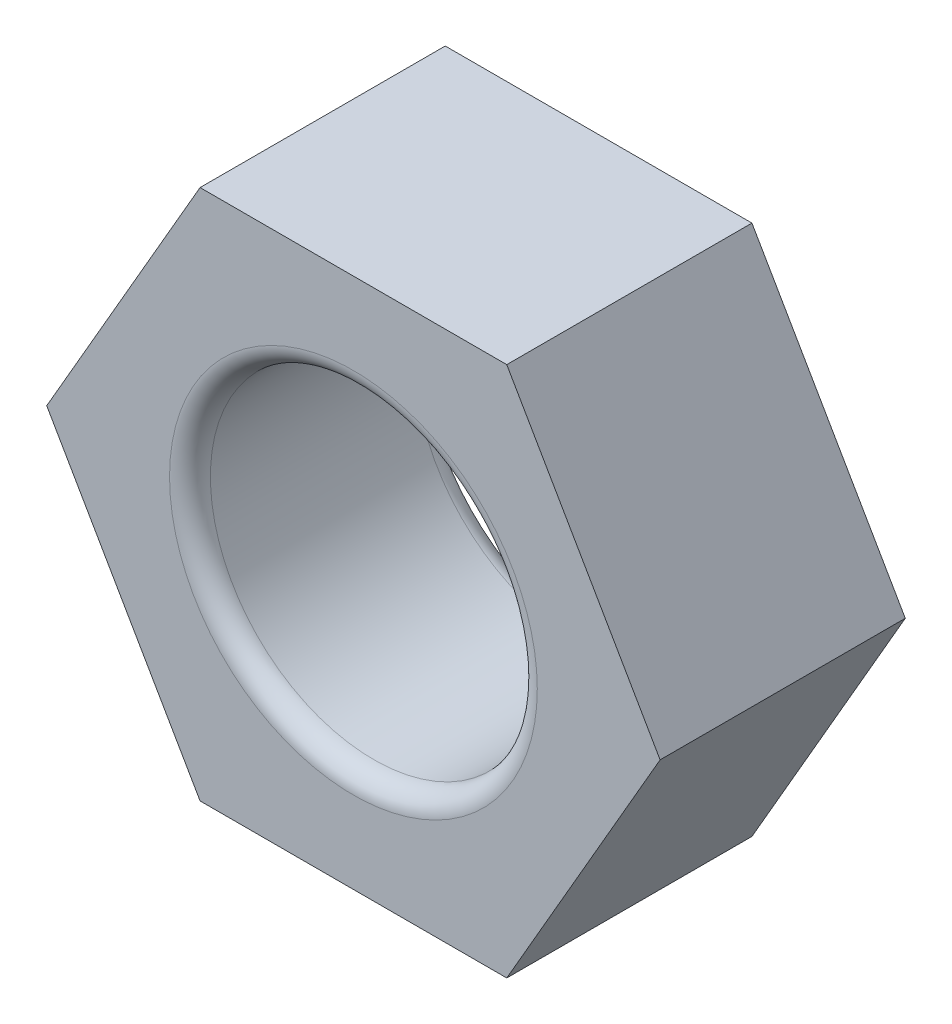
ISO-10303-21;
HEADER;
FILE_DESCRIPTION(('STEP AP214'),'2;1');
FILE_NAME('part.step','',(''),(''),'','','');
FILE_SCHEMA(('AUTOMOTIVE_DESIGN { 1 0 10303 214 1 1 1 1 }'));
ENDSEC;
DATA;
#1=APPLICATION_CONTEXT('core data for automotive mechanical design processes');
#2=APPLICATION_PROTOCOL_DEFINITION('international standard','automotive_design',2000,#1);
#3=PRODUCT_CONTEXT('',#1,'mechanical');
#4=PRODUCT('Part','Part','',(#3));
#5=PRODUCT_RELATED_PRODUCT_CATEGORY('part','',(#4));
#6=PRODUCT_DEFINITION_FORMATION('','',#4);
#7=PRODUCT_DEFINITION_CONTEXT('part definition',#1,'design');
#8=PRODUCT_DEFINITION('design','',#6,#7);
#9=PRODUCT_DEFINITION_SHAPE('','',#8);
#10=(LENGTH_UNIT() NAMED_UNIT(*) SI_UNIT(.MILLI.,.METRE.));
#11=(NAMED_UNIT(*) PLANE_ANGLE_UNIT() SI_UNIT($,.RADIAN.));
#12=(NAMED_UNIT(*) SI_UNIT($,.STERADIAN.) SOLID_ANGLE_UNIT());
#13=UNCERTAINTY_MEASURE_WITH_UNIT(LENGTH_MEASURE(1.E-05),#10,'distance_accuracy_value','');
#14=(GEOMETRIC_REPRESENTATION_CONTEXT(3) GLOBAL_UNCERTAINTY_ASSIGNED_CONTEXT((#13)) GLOBAL_UNIT_ASSIGNED_CONTEXT((#10,
#11,#12)) REPRESENTATION_CONTEXT('',''));
#15=CARTESIAN_POINT('',(0.,0.,0.));
#16=DIRECTION('',(0.,0.,1.));
#17=DIRECTION('',(1.,0.,0.));
#18=AXIS2_PLACEMENT_3D('',#15,#16,#17);
#19=CARTESIAN_POINT('',(-7.50555349946511,0.,6.));
#20=DIRECTION('',(0.,0.,1.));
#21=DIRECTION('',(1.,0.,0.));
#22=AXIS2_PLACEMENT_3D('',#19,#20,#21);
#23=PLANE('',#22);
#24=CARTESIAN_POINT('',(0.,0.,6.));
#25=DIRECTION('',(0.,0.,1.));
#26=DIRECTION('',(1.,0.,0.));
#27=AXIS2_PLACEMENT_3D('',#24,#25,#26);
#28=CIRCLE('',#27,4.5);
#29=CARTESIAN_POINT('',(4.5,0.,6.));
#30=VERTEX_POINT('',#29);
#31=EDGE_CURVE('E11',#30,#30,#28,.F.);
#32=ORIENTED_EDGE('',*,*,#31,.T.);
#33=EDGE_LOOP('',(#32));
#34=FACE_BOUND('',#33,.T.);
#35=DIRECTION('',(-0.500000000000007,-0.866025403784434,0.));
#36=VECTOR('',#35,1.);
#37=CARTESIAN_POINT('',(-3.75277674973252,6.5,6.));
#38=LINE('',#37,#36);
#39=CARTESIAN_POINT('',(-3.75277674973252,6.5,6.));
#40=VERTEX_POINT('',#39);
#41=CARTESIAN_POINT('',(-7.50555349946511,0.,6.));
#42=VERTEX_POINT('',#41);
#43=EDGE_CURVE('E126',#40,#42,#38,.T.);
#44=ORIENTED_EDGE('',*,*,#43,.T.);
#45=DIRECTION('',(0.499999999999998,-0.86602540378444,0.));
#46=VECTOR('',#45,1.);
#47=CARTESIAN_POINT('',(-7.50555349946511,0.,6.));
#48=LINE('',#47,#46);
#49=CARTESIAN_POINT('',(-3.75277674973253,-6.49999999999997,6.));
#50=VERTEX_POINT('',#49);
#51=EDGE_CURVE('E86',#42,#50,#48,.T.);
#52=ORIENTED_EDGE('',*,*,#51,.T.);
#53=DIRECTION('',(1.,0.,0.));
#54=VECTOR('',#53,1.);
#55=CARTESIAN_POINT('',(-3.75277674973253,-6.49999999999997,6.));
#56=LINE('',#55,#54);
#57=CARTESIAN_POINT('',(3.75277674973263,-6.49999999999986,6.));
#58=VERTEX_POINT('',#57);
#59=EDGE_CURVE('E98',#50,#58,#56,.T.);
#60=ORIENTED_EDGE('',*,*,#59,.T.);
#61=DIRECTION('',(0.500000000000013,0.866025403784431,0.));
#62=VECTOR('',#61,1.);
#63=CARTESIAN_POINT('',(3.75277674973263,-6.49999999999986,6.));
#64=LINE('',#63,#62);
#65=CARTESIAN_POINT('',(7.5055534994653,0.,6.));
#66=VERTEX_POINT('',#65);
#67=EDGE_CURVE('E93',#58,#66,#64,.T.);
#68=ORIENTED_EDGE('',*,*,#67,.T.);
#69=DIRECTION('',(-0.5,0.866025403784439,0.));
#70=VECTOR('',#69,1.);
#71=CARTESIAN_POINT('',(7.5055534994653,0.,6.));
#72=LINE('',#71,#70);
#73=CARTESIAN_POINT('',(3.7527767497327,6.50000000000014,6.));
#74=VERTEX_POINT('',#73);
#75=EDGE_CURVE('E96',#66,#74,#72,.T.);
#76=ORIENTED_EDGE('',*,*,#75,.T.);
#77=DIRECTION('',(-1.,0.,0.));
#78=VECTOR('',#77,1.);
#79=CARTESIAN_POINT('',(3.7527767497327,6.50000000000014,6.));
#80=LINE('',#79,#78);
#81=EDGE_CURVE('E48',#74,#40,#80,.T.);
#82=ORIENTED_EDGE('',*,*,#81,.T.);
#83=EDGE_LOOP('',(#44,#52,#60,#68,#76,#82));
#84=FACE_BOUND('',#83,.T.);
#85=ADVANCED_FACE('F31',(#34,#84),#23,.T.);
#86=CARTESIAN_POINT('',(-7.50555349946511,0.,0.));
#87=DIRECTION('',(0.,0.,1.));
#88=DIRECTION('',(1.,0.,0.));
#89=AXIS2_PLACEMENT_3D('',#86,#87,#88);
#90=PLANE('',#89);
#91=CARTESIAN_POINT('',(0.,0.,0.));
#92=DIRECTION('',(0.,0.,1.));
#93=DIRECTION('',(1.,0.,0.));
#94=AXIS2_PLACEMENT_3D('',#91,#92,#93);
#95=CIRCLE('',#94,4.5);
#96=CARTESIAN_POINT('',(4.5,0.,0.));
#97=VERTEX_POINT('',#96);
#98=EDGE_CURVE('E135',#97,#97,#95,.T.);
#99=ORIENTED_EDGE('',*,*,#98,.T.);
#100=EDGE_LOOP('',(#99));
#101=FACE_BOUND('',#100,.T.);
#102=DIRECTION('',(-0.500000000000007,-0.866025403784434,0.));
#103=VECTOR('',#102,1.);
#104=CARTESIAN_POINT('',(-3.75277674973252,6.5,0.));
#105=LINE('',#104,#103);
#106=CARTESIAN_POINT('',(-3.75277674973252,6.5,0.));
#107=VERTEX_POINT('',#106);
#108=CARTESIAN_POINT('',(-7.50555349946511,0.,0.));
#109=VERTEX_POINT('',#108);
#110=EDGE_CURVE('E116',#107,#109,#105,.T.);
#111=ORIENTED_EDGE('',*,*,#110,.F.);
#112=DIRECTION('',(-1.,0.,0.));
#113=VECTOR('',#112,1.);
#114=CARTESIAN_POINT('',(3.7527767497327,6.50000000000014,0.));
#115=LINE('',#114,#113);
#116=CARTESIAN_POINT('',(3.7527767497327,6.50000000000014,0.));
#117=VERTEX_POINT('',#116);
#118=EDGE_CURVE('E77',#117,#107,#115,.T.);
#119=ORIENTED_EDGE('',*,*,#118,.F.);
#120=DIRECTION('',(-0.5,0.866025403784439,0.));
#121=VECTOR('',#120,1.);
#122=CARTESIAN_POINT('',(7.5055534994653,0.,0.));
#123=LINE('',#122,#121);
#124=CARTESIAN_POINT('',(7.5055534994653,0.,0.));
#125=VERTEX_POINT('',#124);
#126=EDGE_CURVE('E71',#125,#117,#123,.T.);
#127=ORIENTED_EDGE('',*,*,#126,.F.);
#128=DIRECTION('',(0.500000000000013,0.866025403784431,0.));
#129=VECTOR('',#128,1.);
#130=CARTESIAN_POINT('',(3.75277674973263,-6.49999999999986,0.));
#131=LINE('',#130,#129);
#132=CARTESIAN_POINT('',(3.75277674973263,-6.49999999999986,0.));
#133=VERTEX_POINT('',#132);
#134=EDGE_CURVE('E106',#133,#125,#131,.T.);
#135=ORIENTED_EDGE('',*,*,#134,.F.);
#136=DIRECTION('',(1.,0.,0.));
#137=VECTOR('',#136,1.);
#138=CARTESIAN_POINT('',(-3.75277674973253,-6.49999999999997,0.));
#139=LINE('',#138,#137);
#140=CARTESIAN_POINT('',(-3.75277674973253,-6.49999999999997,0.));
#141=VERTEX_POINT('',#140);
#142=EDGE_CURVE('E121',#141,#133,#139,.T.);
#143=ORIENTED_EDGE('',*,*,#142,.F.);
#144=DIRECTION('',(0.499999999999998,-0.86602540378444,0.));
#145=VECTOR('',#144,1.);
#146=CARTESIAN_POINT('',(-7.50555349946511,0.,0.));
#147=LINE('',#146,#145);
#148=EDGE_CURVE('E119',#109,#141,#147,.T.);
#149=ORIENTED_EDGE('',*,*,#148,.F.);
#150=EDGE_LOOP('',(#111,#119,#127,#135,#143,#149));
#151=FACE_BOUND('',#150,.T.);
#152=ADVANCED_FACE('F151',(#101,#151),#90,.F.);
#153=CARTESIAN_POINT('',(-3.75277674973252,6.5,6.));
#154=DIRECTION('',(0.866025403784434,-0.500000000000007,0.));
#155=DIRECTION('',(0.500000000000007,0.866025403784435,0.));
#156=AXIS2_PLACEMENT_3D('',#153,#154,#155);
#157=PLANE('',#156);
#158=ORIENTED_EDGE('',*,*,#110,.T.);
#159=DIRECTION('',(0.,0.,-1.));
#160=VECTOR('',#159,1.);
#161=CARTESIAN_POINT('',(-7.50555349946511,0.,6.));
#162=LINE('',#161,#160);
#163=EDGE_CURVE('E133',#42,#109,#162,.T.);
#164=ORIENTED_EDGE('',*,*,#163,.F.);
#165=ORIENTED_EDGE('',*,*,#43,.F.);
#166=DIRECTION('',(0.,0.,-1.));
#167=VECTOR('',#166,1.);
#168=CARTESIAN_POINT('',(-3.75277674973252,6.5,6.));
#169=LINE('',#168,#167);
#170=EDGE_CURVE('E112',#40,#107,#169,.T.);
#171=ORIENTED_EDGE('',*,*,#170,.T.);
#172=EDGE_LOOP('',(#158,#164,#165,#171));
#173=FACE_BOUND('',#172,.T.);
#174=ADVANCED_FACE('F154',(#173),#157,.F.);
#175=CARTESIAN_POINT('',(-7.50555349946511,0.,6.));
#176=DIRECTION('',(0.86602540378444,0.499999999999998,0.));
#177=DIRECTION('',(-0.499999999999998,0.86602540378444,0.));
#178=AXIS2_PLACEMENT_3D('',#175,#176,#177);
#179=PLANE('',#178);
#180=ORIENTED_EDGE('',*,*,#148,.T.);
#181=DIRECTION('',(0.,0.,-1.));
#182=VECTOR('',#181,1.);
#183=CARTESIAN_POINT('',(-3.75277674973253,-6.49999999999997,6.));
#184=LINE('',#183,#182);
#185=EDGE_CURVE('E130',#50,#141,#184,.T.);
#186=ORIENTED_EDGE('',*,*,#185,.F.);
#187=ORIENTED_EDGE('',*,*,#51,.F.);
#188=ORIENTED_EDGE('',*,*,#163,.T.);
#189=EDGE_LOOP('',(#180,#186,#187,#188));
#190=FACE_BOUND('',#189,.T.);
#191=ADVANCED_FACE('F230',(#190),#179,.F.);
#192=CARTESIAN_POINT('',(-3.75277674973253,-6.49999999999997,6.));
#193=DIRECTION('',(0.,1.,0.));
#194=DIRECTION('',(-1.,0.,0.));
#195=AXIS2_PLACEMENT_3D('',#192,#193,#194);
#196=PLANE('',#195);
#197=ORIENTED_EDGE('',*,*,#142,.T.);
#198=DIRECTION('',(0.,0.,-1.));
#199=VECTOR('',#198,1.);
#200=CARTESIAN_POINT('',(3.75277674973263,-6.49999999999986,6.));
#201=LINE('',#200,#199);
#202=EDGE_CURVE('E107',#58,#133,#201,.T.);
#203=ORIENTED_EDGE('',*,*,#202,.F.);
#204=ORIENTED_EDGE('',*,*,#59,.F.);
#205=ORIENTED_EDGE('',*,*,#185,.T.);
#206=EDGE_LOOP('',(#197,#203,#204,#205));
#207=FACE_BOUND('',#206,.T.);
#208=ADVANCED_FACE('F221',(#207),#196,.F.);
#209=CARTESIAN_POINT('',(3.75277674973263,-6.49999999999986,6.));
#210=DIRECTION('',(-0.866025403784431,0.500000000000013,0.));
#211=DIRECTION('',(-0.500000000000013,-0.866025403784431,0.));
#212=AXIS2_PLACEMENT_3D('',#209,#210,#211);
#213=PLANE('',#212);
#214=ORIENTED_EDGE('',*,*,#134,.T.);
#215=DIRECTION('',(0.,0.,-1.));
#216=VECTOR('',#215,1.);
#217=CARTESIAN_POINT('',(7.5055534994653,0.,6.));
#218=LINE('',#217,#216);
#219=EDGE_CURVE('E103',#66,#125,#218,.T.);
#220=ORIENTED_EDGE('',*,*,#219,.F.);
#221=ORIENTED_EDGE('',*,*,#67,.F.);
#222=ORIENTED_EDGE('',*,*,#202,.T.);
#223=EDGE_LOOP('',(#214,#220,#221,#222));
#224=FACE_BOUND('',#223,.T.);
#225=ADVANCED_FACE('F104',(#224),#213,.F.);
#226=CARTESIAN_POINT('',(7.5055534994653,0.,6.));
#227=DIRECTION('',(-0.866025403784439,-0.5,0.));
#228=DIRECTION('',(0.5,-0.866025403784439,0.));
#229=AXIS2_PLACEMENT_3D('',#226,#227,#228);
#230=PLANE('',#229);
#231=ORIENTED_EDGE('',*,*,#126,.T.);
#232=DIRECTION('',(0.,0.,-1.));
#233=VECTOR('',#232,1.);
#234=CARTESIAN_POINT('',(3.7527767497327,6.50000000000014,6.));
#235=LINE('',#234,#233);
#236=EDGE_CURVE('E108',#74,#117,#235,.T.);
#237=ORIENTED_EDGE('',*,*,#236,.F.);
#238=ORIENTED_EDGE('',*,*,#75,.F.);
#239=ORIENTED_EDGE('',*,*,#219,.T.);
#240=EDGE_LOOP('',(#231,#237,#238,#239));
#241=FACE_BOUND('',#240,.T.);
#242=ADVANCED_FACE('F110',(#241),#230,.F.);
#243=CARTESIAN_POINT('',(3.7527767497327,6.50000000000014,6.));
#244=DIRECTION('',(0.,-1.,0.));
#245=DIRECTION('',(1.,0.,0.));
#246=AXIS2_PLACEMENT_3D('',#243,#244,#245);
#247=PLANE('',#246);
#248=ORIENTED_EDGE('',*,*,#118,.T.);
#249=ORIENTED_EDGE('',*,*,#170,.F.);
#250=ORIENTED_EDGE('',*,*,#81,.F.);
#251=ORIENTED_EDGE('',*,*,#236,.T.);
#252=EDGE_LOOP('',(#248,#249,#250,#251));
#253=FACE_BOUND('',#252,.T.);
#254=ADVANCED_FACE('F161',(#253),#247,.F.);
#255=CARTESIAN_POINT('',(0.,0.,6.));
#256=DIRECTION('',(0.,0.,-1.));
#257=DIRECTION('',(-1.,0.,0.));
#258=AXIS2_PLACEMENT_3D('',#255,#256,#257);
#259=CYLINDRICAL_SURFACE('',#258,4.);
#260=CARTESIAN_POINT('',(0.,0.,0.5));
#261=DIRECTION('',(0.,0.,1.));
#262=DIRECTION('',(1.,0.,0.));
#263=AXIS2_PLACEMENT_3D('',#260,#261,#262);
#264=CIRCLE('',#263,4.);
#265=CARTESIAN_POINT('',(4.,0.,0.5));
#266=VERTEX_POINT('',#265);
#267=EDGE_CURVE('E40',#266,#266,#264,.F.);
#268=ORIENTED_EDGE('',*,*,#267,.T.);
#269=EDGE_LOOP('',(#268));
#270=FACE_BOUND('',#269,.T.);
#271=CARTESIAN_POINT('',(0.,0.,5.5));
#272=DIRECTION('',(0.,0.,1.));
#273=DIRECTION('',(1.,0.,0.));
#274=AXIS2_PLACEMENT_3D('',#271,#272,#273);
#275=CIRCLE('',#274,4.);
#276=CARTESIAN_POINT('',(4.,0.,5.5));
#277=VERTEX_POINT('',#276);
#278=EDGE_CURVE('E138',#277,#277,#275,.T.);
#279=ORIENTED_EDGE('',*,*,#278,.T.);
#280=EDGE_LOOP('',(#279));
#281=FACE_BOUND('',#280,.T.);
#282=ADVANCED_FACE('F143',(#270,#281),#259,.F.);
#283=CARTESIAN_POINT('',(0.,0.,0.5));
#284=DIRECTION('',(0.,0.,1.));
#285=DIRECTION('',(1.,0.,0.));
#286=AXIS2_PLACEMENT_3D('',#283,#284,#285);
#287=TOROIDAL_SURFACE('',#286,4.5,0.5);
#288=ORIENTED_EDGE('',*,*,#267,.F.);
#289=EDGE_LOOP('',(#288));
#290=FACE_BOUND('',#289,.T.);
#291=ORIENTED_EDGE('',*,*,#98,.F.);
#292=EDGE_LOOP('',(#291));
#293=FACE_BOUND('',#292,.T.);
#294=ADVANCED_FACE('F146',(#290,#293),#287,.T.);
#295=CARTESIAN_POINT('',(0.,0.,5.5));
#296=DIRECTION('',(0.,0.,1.));
#297=DIRECTION('',(1.,0.,0.));
#298=AXIS2_PLACEMENT_3D('',#295,#296,#297);
#299=TOROIDAL_SURFACE('',#298,4.5,0.5);
#300=ORIENTED_EDGE('',*,*,#31,.F.);
#301=EDGE_LOOP('',(#300));
#302=FACE_BOUND('',#301,.T.);
#303=ORIENTED_EDGE('',*,*,#278,.F.);
#304=EDGE_LOOP('',(#303));
#305=FACE_BOUND('',#304,.T.);
#306=ADVANCED_FACE('F33',(#302,#305),#299,.T.);
#307=CLOSED_SHELL('',(#85,#152,#174,#191,#208,#225,#242,#254,#282,#294,#306));
#308=MANIFOLD_SOLID_BREP('B2',#307);
#309=ADVANCED_BREP_SHAPE_REPRESENTATION('',(#18,#308),#14);
#310=SHAPE_DEFINITION_REPRESENTATION(#9,#309);
ENDSEC;
END-ISO-10303-21;
